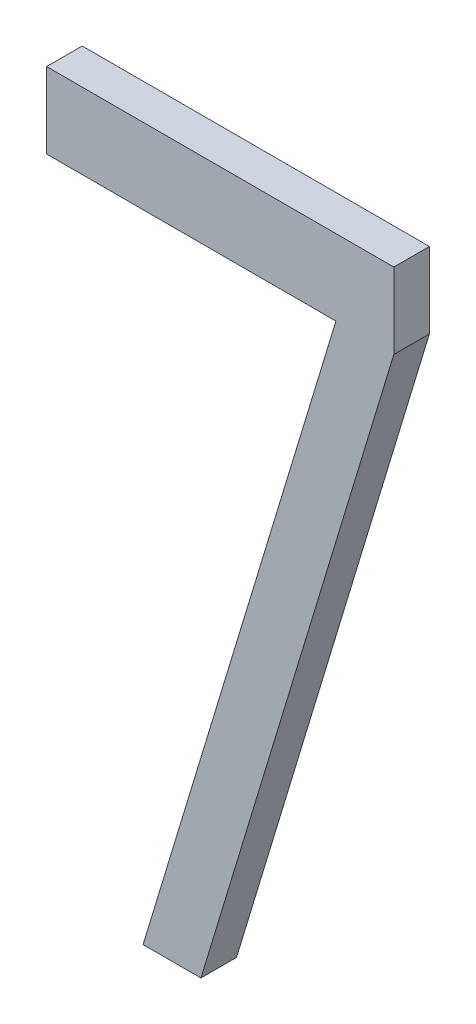
ISO-10303-21;
HEADER;
FILE_DESCRIPTION(('STEP AP214'),'2;1');
FILE_NAME('part.step','',(''),(''),'','','');
FILE_SCHEMA(('AUTOMOTIVE_DESIGN { 1 0 10303 214 1 1 1 1 }'));
ENDSEC;
DATA;
#1=APPLICATION_CONTEXT('core data for automotive mechanical design processes');
#2=APPLICATION_PROTOCOL_DEFINITION('international standard','automotive_design',2000,#1);
#3=PRODUCT_CONTEXT('',#1,'mechanical');
#4=PRODUCT('Part','Part','',(#3));
#5=PRODUCT_RELATED_PRODUCT_CATEGORY('part','',(#4));
#6=PRODUCT_DEFINITION_FORMATION('','',#4);
#7=PRODUCT_DEFINITION_CONTEXT('part definition',#1,'design');
#8=PRODUCT_DEFINITION('design','',#6,#7);
#9=PRODUCT_DEFINITION_SHAPE('','',#8);
#10=(LENGTH_UNIT() NAMED_UNIT(*) SI_UNIT(.MILLI.,.METRE.));
#11=(NAMED_UNIT(*) PLANE_ANGLE_UNIT() SI_UNIT($,.RADIAN.));
#12=(NAMED_UNIT(*) SI_UNIT($,.STERADIAN.) SOLID_ANGLE_UNIT());
#13=UNCERTAINTY_MEASURE_WITH_UNIT(LENGTH_MEASURE(1.E-05),#10,'distance_accuracy_value','');
#14=(GEOMETRIC_REPRESENTATION_CONTEXT(3) GLOBAL_UNCERTAINTY_ASSIGNED_CONTEXT((#13)) GLOBAL_UNIT_ASSIGNED_CONTEXT((#10,
#11,#12)) REPRESENTATION_CONTEXT('',''));
#15=CARTESIAN_POINT('',(0.,0.,0.));
#16=DIRECTION('',(0.,0.,1.));
#17=DIRECTION('',(1.,0.,0.));
#18=AXIS2_PLACEMENT_3D('',#15,#16,#17);
#19=CARTESIAN_POINT('',(149.356497806007,30.0779050863982,5.9));
#20=DIRECTION('',(0.,0.,1.));
#21=DIRECTION('',(1.,0.,0.));
#22=AXIS2_PLACEMENT_3D('',#19,#20,#21);
#23=PLANE('',#22);
#24=DIRECTION('',(1.,0.,0.));
#25=VECTOR('',#24,1.);
#26=CARTESIAN_POINT('',(149.356497806007,30.2906710184782,5.9));
#27=LINE('',#26,#25);
#28=CARTESIAN_POINT('',(150.331497728512,30.2906710184782,5.9));
#29=VERTEX_POINT('',#28);
#30=CARTESIAN_POINT('',(149.356497806007,30.2906710184782,5.9));
#31=VERTEX_POINT('',#30);
#32=EDGE_CURVE('E83',#29,#31,#27,.F.);
#33=ORIENTED_EDGE('',*,*,#32,.F.);
#34=DIRECTION('',(0.,1.,0.));
#35=VECTOR('',#34,1.);
#36=CARTESIAN_POINT('',(150.331497728517,30.0779050863982,5.9));
#37=LINE('',#36,#35);
#38=CARTESIAN_POINT('',(150.331497728514,30.0779050863954,5.9));
#39=VERTEX_POINT('',#38);
#40=EDGE_CURVE('E20',#39,#29,#37,.T.);
#41=ORIENTED_EDGE('',*,*,#40,.F.);
#42=DIRECTION('',(-0.2900468917061,-0.957012434930513,0.));
#43=VECTOR('',#42,1.);
#44=CARTESIAN_POINT('',(149.789831113507,28.2906710184782,5.9));
#45=LINE('',#44,#43);
#46=CARTESIAN_POINT('',(149.789831113508,28.2906710184789,5.9));
#47=VERTEX_POINT('',#46);
#48=EDGE_CURVE('E108',#39,#47,#45,.T.);
#49=ORIENTED_EDGE('',*,*,#48,.T.);
#50=DIRECTION('',(1.,0.,0.));
#51=VECTOR('',#50,1.);
#52=CARTESIAN_POINT('',(149.627331113507,28.2906710184782,5.9));
#53=LINE('',#52,#51);
#54=CARTESIAN_POINT('',(149.627331113498,28.2906710184804,5.9));
#55=VERTEX_POINT('',#54);
#56=EDGE_CURVE('E103',#47,#55,#53,.F.);
#57=ORIENTED_EDGE('',*,*,#56,.T.);
#58=DIRECTION('',(0.290046891706108,0.957012434930511,0.));
#59=VECTOR('',#58,1.);
#60=CARTESIAN_POINT('',(150.168997728507,30.0779050863982,5.9));
#61=LINE('',#60,#59);
#62=CARTESIAN_POINT('',(150.168997728507,30.0779050863982,5.9));
#63=VERTEX_POINT('',#62);
#64=EDGE_CURVE('E98',#55,#63,#61,.T.);
#65=ORIENTED_EDGE('',*,*,#64,.T.);
#66=DIRECTION('',(1.,0.,0.));
#67=VECTOR('',#66,1.);
#68=CARTESIAN_POINT('',(149.356497806007,30.0779050863982,5.9));
#69=LINE('',#68,#67);
#70=CARTESIAN_POINT('',(149.356497806007,30.0779050863982,5.9));
#71=VERTEX_POINT('',#70);
#72=EDGE_CURVE('E94',#63,#71,#69,.F.);
#73=ORIENTED_EDGE('',*,*,#72,.T.);
#74=DIRECTION('',(0.,1.,0.));
#75=VECTOR('',#74,1.);
#76=CARTESIAN_POINT('',(149.356497806007,30.2906710184782,5.9));
#77=LINE('',#76,#75);
#78=EDGE_CURVE('E74',#71,#31,#77,.T.);
#79=ORIENTED_EDGE('',*,*,#78,.T.);
#80=EDGE_LOOP('',(#33,#41,#49,#57,#65,#73,#79));
#81=FACE_BOUND('',#80,.T.);
#82=ADVANCED_FACE('F17',(#81),#23,.F.);
#83=CARTESIAN_POINT('',(149.356497806007,30.2906710184782,6.));
#84=DIRECTION('',(1.,0.,0.));
#85=DIRECTION('',(0.,0.,-1.));
#86=AXIS2_PLACEMENT_3D('',#83,#84,#85);
#87=PLANE('',#86);
#88=DIRECTION('',(0.,0.,1.));
#89=VECTOR('',#88,1.);
#90=CARTESIAN_POINT('',(149.356497806007,30.0779050863982,6.));
#91=LINE('',#90,#89);
#92=CARTESIAN_POINT('',(149.356497806007,30.0779050863982,6.));
#93=VERTEX_POINT('',#92);
#94=EDGE_CURVE('E90',#71,#93,#91,.T.);
#95=ORIENTED_EDGE('',*,*,#94,.T.);
#96=DIRECTION('',(0.,1.,0.));
#97=VECTOR('',#96,1.);
#98=CARTESIAN_POINT('',(149.356497806007,30.0779050863982,6.));
#99=LINE('',#98,#97);
#100=CARTESIAN_POINT('',(149.356497806007,30.2906710184782,6.));
#101=VERTEX_POINT('',#100);
#102=EDGE_CURVE('E112',#101,#93,#99,.F.);
#103=ORIENTED_EDGE('',*,*,#102,.F.);
#104=DIRECTION('',(0.,0.,-1.));
#105=VECTOR('',#104,1.);
#106=CARTESIAN_POINT('',(149.356497806007,30.2906710184782,6.));
#107=LINE('',#106,#105);
#108=EDGE_CURVE('E88',#101,#31,#107,.T.);
#109=ORIENTED_EDGE('',*,*,#108,.T.);
#110=ORIENTED_EDGE('',*,*,#78,.F.);
#111=EDGE_LOOP('',(#95,#103,#109,#110));
#112=FACE_BOUND('',#111,.T.);
#113=ADVANCED_FACE('F145',(#112),#87,.F.);
#114=CARTESIAN_POINT('',(149.356497806007,30.0779050863982,6.));
#115=DIRECTION('',(0.,1.,0.));
#116=DIRECTION('',(0.,0.,1.));
#117=AXIS2_PLACEMENT_3D('',#114,#115,#116);
#118=PLANE('',#117);
#119=DIRECTION('',(0.,0.,1.));
#120=VECTOR('',#119,1.);
#121=CARTESIAN_POINT('',(150.168997728507,30.0779050863982,6.));
#122=LINE('',#121,#120);
#123=CARTESIAN_POINT('',(150.168997728507,30.0779050863982,6.));
#124=VERTEX_POINT('',#123);
#125=EDGE_CURVE('E96',#63,#124,#122,.T.);
#126=ORIENTED_EDGE('',*,*,#125,.T.);
#127=DIRECTION('',(1.,0.,0.));
#128=VECTOR('',#127,1.);
#129=CARTESIAN_POINT('',(149.356497806007,30.0779050863982,6.));
#130=LINE('',#129,#128);
#131=EDGE_CURVE('E115',#93,#124,#130,.T.);
#132=ORIENTED_EDGE('',*,*,#131,.F.);
#133=ORIENTED_EDGE('',*,*,#94,.F.);
#134=ORIENTED_EDGE('',*,*,#72,.F.);
#135=EDGE_LOOP('',(#126,#132,#133,#134));
#136=FACE_BOUND('',#135,.T.);
#137=ADVANCED_FACE('F143',(#136),#118,.F.);
#138=CARTESIAN_POINT('',(150.168997728507,30.0779050863982,6.));
#139=DIRECTION('',(0.957012434930511,-0.290046891706108,0.));
#140=DIRECTION('',(0.290046891706108,0.957012434930511,0.));
#141=AXIS2_PLACEMENT_3D('',#138,#139,#140);
#142=PLANE('',#141);
#143=DIRECTION('',(0.,0.,1.));
#144=VECTOR('',#143,1.);
#145=CARTESIAN_POINT('',(149.627331113498,28.2906710184782,6.));
#146=LINE('',#145,#144);
#147=CARTESIAN_POINT('',(149.627331113498,28.2906710184804,6.));
#148=VERTEX_POINT('',#147);
#149=EDGE_CURVE('E101',#55,#148,#146,.T.);
#150=ORIENTED_EDGE('',*,*,#149,.T.);
#151=DIRECTION('',(-0.290046891706103,-0.957012434930512,0.));
#152=VECTOR('',#151,1.);
#153=CARTESIAN_POINT('',(150.168997728507,30.0779050863982,6.));
#154=LINE('',#153,#152);
#155=EDGE_CURVE('E118',#124,#148,#154,.T.);
#156=ORIENTED_EDGE('',*,*,#155,.F.);
#157=ORIENTED_EDGE('',*,*,#125,.F.);
#158=ORIENTED_EDGE('',*,*,#64,.F.);
#159=EDGE_LOOP('',(#150,#156,#157,#158));
#160=FACE_BOUND('',#159,.T.);
#161=ADVANCED_FACE('F140',(#160),#142,.F.);
#162=CARTESIAN_POINT('',(149.627331113507,28.2906710184782,6.));
#163=DIRECTION('',(0.,1.,0.));
#164=DIRECTION('',(0.,0.,1.));
#165=AXIS2_PLACEMENT_3D('',#162,#163,#164);
#166=PLANE('',#165);
#167=DIRECTION('',(0.,0.,1.));
#168=VECTOR('',#167,1.);
#169=CARTESIAN_POINT('',(149.789831113507,28.2906710184782,6.));
#170=LINE('',#169,#168);
#171=CARTESIAN_POINT('',(149.789831113508,28.2906710184789,6.));
#172=VERTEX_POINT('',#171);
#173=EDGE_CURVE('E106',#47,#172,#170,.T.);
#174=ORIENTED_EDGE('',*,*,#173,.T.);
#175=DIRECTION('',(1.,0.,0.));
#176=VECTOR('',#175,1.);
#177=CARTESIAN_POINT('',(149.356497806007,28.2906710184811,6.));
#178=LINE('',#177,#176);
#179=EDGE_CURVE('E121',#148,#172,#178,.T.);
#180=ORIENTED_EDGE('',*,*,#179,.F.);
#181=ORIENTED_EDGE('',*,*,#149,.F.);
#182=ORIENTED_EDGE('',*,*,#56,.F.);
#183=EDGE_LOOP('',(#174,#180,#181,#182));
#184=FACE_BOUND('',#183,.T.);
#185=ADVANCED_FACE('F137',(#184),#166,.F.);
#186=CARTESIAN_POINT('',(149.789831113507,28.2906710184782,6.));
#187=DIRECTION('',(-0.957012434930513,0.2900468917061,0.));
#188=DIRECTION('',(-0.2900468917061,-0.957012434930513,0.));
#189=AXIS2_PLACEMENT_3D('',#186,#187,#188);
#190=PLANE('',#189);
#191=DIRECTION('',(0.,0.,1.));
#192=VECTOR('',#191,1.);
#193=CARTESIAN_POINT('',(150.331497728507,30.0779050863954,6.));
#194=LINE('',#193,#192);
#195=CARTESIAN_POINT('',(150.331497728514,30.0779050863954,6.));
#196=VERTEX_POINT('',#195);
#197=EDGE_CURVE('E78',#39,#196,#194,.T.);
#198=ORIENTED_EDGE('',*,*,#197,.T.);
#199=DIRECTION('',(0.290046891706089,0.957012434930517,0.));
#200=VECTOR('',#199,1.);
#201=CARTESIAN_POINT('',(149.789831113507,28.2906710184782,6.));
#202=LINE('',#201,#200);
#203=EDGE_CURVE('E124',#172,#196,#202,.T.);
#204=ORIENTED_EDGE('',*,*,#203,.F.);
#205=ORIENTED_EDGE('',*,*,#173,.F.);
#206=ORIENTED_EDGE('',*,*,#48,.F.);
#207=EDGE_LOOP('',(#198,#204,#205,#206));
#208=FACE_BOUND('',#207,.T.);
#209=ADVANCED_FACE('F133',(#208),#190,.F.);
#210=CARTESIAN_POINT('',(150.331497728507,30.0779050863982,6.));
#211=DIRECTION('',(-1.,0.,0.));
#212=DIRECTION('',(0.,0.,1.));
#213=AXIS2_PLACEMENT_3D('',#210,#211,#212);
#214=PLANE('',#213);
#215=DIRECTION('',(0.,0.,-1.));
#216=VECTOR('',#215,1.);
#217=CARTESIAN_POINT('',(150.331497728507,30.2906710184782,6.));
#218=LINE('',#217,#216);
#219=CARTESIAN_POINT('',(150.33149772851,30.2906710184782,6.));
#220=VERTEX_POINT('',#219);
#221=EDGE_CURVE('E35',#29,#220,#218,.F.);
#222=ORIENTED_EDGE('',*,*,#221,.T.);
#223=DIRECTION('',(0.,1.,0.));
#224=VECTOR('',#223,1.);
#225=CARTESIAN_POINT('',(150.331497728517,30.0779050863982,6.));
#226=LINE('',#225,#224);
#227=EDGE_CURVE('E26',#196,#220,#226,.T.);
#228=ORIENTED_EDGE('',*,*,#227,.F.);
#229=ORIENTED_EDGE('',*,*,#197,.F.);
#230=ORIENTED_EDGE('',*,*,#40,.T.);
#231=EDGE_LOOP('',(#222,#228,#229,#230));
#232=FACE_BOUND('',#231,.T.);
#233=ADVANCED_FACE('F77',(#232),#214,.F.);
#234=CARTESIAN_POINT('',(150.331497728507,30.2906710184782,6.));
#235=DIRECTION('',(0.,-1.,0.));
#236=DIRECTION('',(0.,0.,-1.));
#237=AXIS2_PLACEMENT_3D('',#234,#235,#236);
#238=PLANE('',#237);
#239=ORIENTED_EDGE('',*,*,#108,.F.);
#240=DIRECTION('',(1.,0.,0.));
#241=VECTOR('',#240,1.);
#242=CARTESIAN_POINT('',(149.356497806007,30.2906710184782,6.));
#243=LINE('',#242,#241);
#244=EDGE_CURVE('E11',#220,#101,#243,.F.);
#245=ORIENTED_EDGE('',*,*,#244,.F.);
#246=ORIENTED_EDGE('',*,*,#221,.F.);
#247=ORIENTED_EDGE('',*,*,#32,.T.);
#248=EDGE_LOOP('',(#239,#245,#246,#247));
#249=FACE_BOUND('',#248,.T.);
#250=ADVANCED_FACE('F86',(#249),#238,.F.);
#251=CARTESIAN_POINT('',(149.356497806007,30.0779050863982,6.));
#252=DIRECTION('',(0.,0.,1.));
#253=DIRECTION('',(1.,0.,0.));
#254=AXIS2_PLACEMENT_3D('',#251,#252,#253);
#255=PLANE('',#254);
#256=ORIENTED_EDGE('',*,*,#227,.T.);
#257=ORIENTED_EDGE('',*,*,#244,.T.);
#258=ORIENTED_EDGE('',*,*,#102,.T.);
#259=ORIENTED_EDGE('',*,*,#131,.T.);
#260=ORIENTED_EDGE('',*,*,#155,.T.);
#261=ORIENTED_EDGE('',*,*,#179,.T.);
#262=ORIENTED_EDGE('',*,*,#203,.T.);
#263=EDGE_LOOP('',(#256,#257,#258,#259,#260,#261,#262));
#264=FACE_BOUND('',#263,.T.);
#265=ADVANCED_FACE('F128',(#264),#255,.T.);
#266=CLOSED_SHELL('',(#82,#113,#137,#161,#185,#209,#233,#250,#265));
#267=MANIFOLD_SOLID_BREP('B1',#266);
#268=ADVANCED_BREP_SHAPE_REPRESENTATION('',(#18,#267),#14);
#269=SHAPE_DEFINITION_REPRESENTATION(#9,#268);
ENDSEC;
END-ISO-10303-21;
